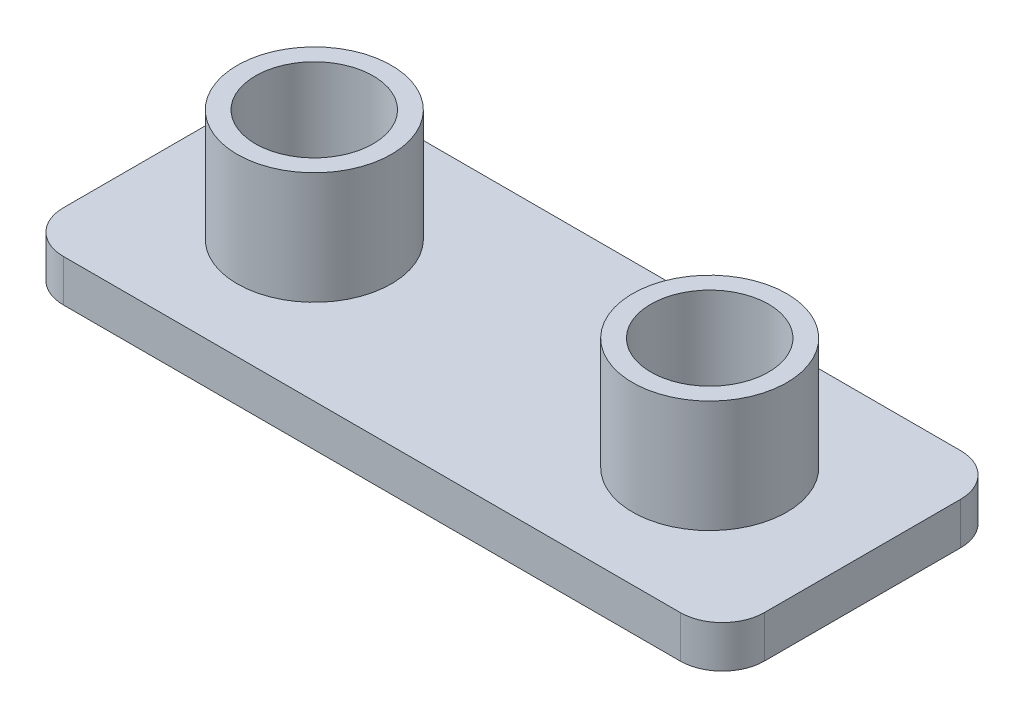
ISO-10303-21;
HEADER;
FILE_DESCRIPTION(('STEP AP214'),'2;1');
FILE_NAME('part.step','',(''),(''),'','','');
FILE_SCHEMA(('AUTOMOTIVE_DESIGN { 1 0 10303 214 1 1 1 1 }'));
ENDSEC;
DATA;
#1=APPLICATION_CONTEXT('core data for automotive mechanical design processes');
#2=APPLICATION_PROTOCOL_DEFINITION('international standard','automotive_design',2000,#1);
#3=PRODUCT_CONTEXT('',#1,'mechanical');
#4=PRODUCT('Part','Part','',(#3));
#5=PRODUCT_RELATED_PRODUCT_CATEGORY('part','',(#4));
#6=PRODUCT_DEFINITION_FORMATION('','',#4);
#7=PRODUCT_DEFINITION_CONTEXT('part definition',#1,'design');
#8=PRODUCT_DEFINITION('design','',#6,#7);
#9=PRODUCT_DEFINITION_SHAPE('','',#8);
#10=(LENGTH_UNIT() NAMED_UNIT(*) SI_UNIT(.MILLI.,.METRE.));
#11=(NAMED_UNIT(*) PLANE_ANGLE_UNIT() SI_UNIT($,.RADIAN.));
#12=(NAMED_UNIT(*) SI_UNIT($,.STERADIAN.) SOLID_ANGLE_UNIT());
#13=UNCERTAINTY_MEASURE_WITH_UNIT(LENGTH_MEASURE(1.E-05),#10,'distance_accuracy_value','');
#14=(GEOMETRIC_REPRESENTATION_CONTEXT(3) GLOBAL_UNCERTAINTY_ASSIGNED_CONTEXT((#13)) GLOBAL_UNIT_ASSIGNED_CONTEXT((#10,
#11,#12)) REPRESENTATION_CONTEXT('',''));
#15=CARTESIAN_POINT('',(0.,0.,0.));
#16=DIRECTION('',(0.,0.,1.));
#17=DIRECTION('',(1.,0.,0.));
#18=AXIS2_PLACEMENT_3D('',#15,#16,#17);
#19=CARTESIAN_POINT('',(-11.,1.5,3.5));
#20=DIRECTION('',(0.,1.,0.));
#21=DIRECTION('',(0.,0.,1.));
#22=AXIS2_PLACEMENT_3D('',#19,#20,#21);
#23=PLANE('',#22);
#24=CARTESIAN_POINT('',(-7.05,1.5,0.));
#25=DIRECTION('',(0.,1.,0.));
#26=DIRECTION('',(0.,0.,1.));
#27=AXIS2_PLACEMENT_3D('',#24,#25,#26);
#28=CIRCLE('',#27,2.75);
#29=CARTESIAN_POINT('',(-7.05,1.5,2.75));
#30=VERTEX_POINT('',#29);
#31=EDGE_CURVE('E187',#30,#30,#28,.T.);
#32=ORIENTED_EDGE('',*,*,#31,.F.);
#33=EDGE_LOOP('',(#32));
#34=FACE_BOUND('',#33,.T.);
#35=CARTESIAN_POINT('',(-11.,1.5,3.5));
#36=DIRECTION('',(0.,1.,0.));
#37=DIRECTION('',(0.,0.,1.));
#38=AXIS2_PLACEMENT_3D('',#35,#36,#37);
#39=CIRCLE('',#38,1.5);
#40=CARTESIAN_POINT('',(-12.5,1.5,3.49999999999999));
#41=VERTEX_POINT('',#40);
#42=CARTESIAN_POINT('',(-11.,1.5,5.));
#43=VERTEX_POINT('',#42);
#44=EDGE_CURVE('E147',#41,#43,#39,.T.);
#45=ORIENTED_EDGE('',*,*,#44,.T.);
#46=DIRECTION('',(1.,0.,0.));
#47=VECTOR('',#46,1.);
#48=CARTESIAN_POINT('',(-11.,1.5,5.));
#49=LINE('',#48,#47);
#50=CARTESIAN_POINT('',(11.,1.5,5.));
#51=VERTEX_POINT('',#50);
#52=EDGE_CURVE('E95',#43,#51,#49,.T.);
#53=ORIENTED_EDGE('',*,*,#52,.T.);
#54=CARTESIAN_POINT('',(11.,1.5,3.5));
#55=DIRECTION('',(0.,1.,0.));
#56=DIRECTION('',(0.,0.,1.));
#57=AXIS2_PLACEMENT_3D('',#54,#55,#56);
#58=CIRCLE('',#57,1.5);
#59=CARTESIAN_POINT('',(12.5,1.5,3.49999999999999));
#60=VERTEX_POINT('',#59);
#61=EDGE_CURVE('E162',#51,#60,#58,.T.);
#62=ORIENTED_EDGE('',*,*,#61,.T.);
#63=DIRECTION('',(0.,0.,-1.));
#64=VECTOR('',#63,1.);
#65=CARTESIAN_POINT('',(12.5,1.5,-3.49999999999999));
#66=LINE('',#65,#64);
#67=CARTESIAN_POINT('',(12.5,1.5,-3.49999999999999));
#68=VERTEX_POINT('',#67);
#69=EDGE_CURVE('E175',#60,#68,#66,.T.);
#70=ORIENTED_EDGE('',*,*,#69,.T.);
#71=CARTESIAN_POINT('',(11.,1.5,-3.5));
#72=DIRECTION('',(0.,1.,0.));
#73=DIRECTION('',(0.,0.,-1.));
#74=AXIS2_PLACEMENT_3D('',#71,#72,#73);
#75=CIRCLE('',#74,1.5);
#76=CARTESIAN_POINT('',(11.,1.5,-5.));
#77=VERTEX_POINT('',#76);
#78=EDGE_CURVE('E114',#68,#77,#75,.T.);
#79=ORIENTED_EDGE('',*,*,#78,.T.);
#80=DIRECTION('',(-1.,0.,0.));
#81=VECTOR('',#80,1.);
#82=CARTESIAN_POINT('',(-11.,1.5,-5.));
#83=LINE('',#82,#81);
#84=CARTESIAN_POINT('',(-11.,1.5,-5.));
#85=VERTEX_POINT('',#84);
#86=EDGE_CURVE('E108',#77,#85,#83,.T.);
#87=ORIENTED_EDGE('',*,*,#86,.T.);
#88=CARTESIAN_POINT('',(-11.,1.5,-3.5));
#89=DIRECTION('',(0.,1.,0.));
#90=DIRECTION('',(0.,0.,1.));
#91=AXIS2_PLACEMENT_3D('',#88,#89,#90);
#92=CIRCLE('',#91,1.5);
#93=CARTESIAN_POINT('',(-12.5,1.5,-3.49999999999999));
#94=VERTEX_POINT('',#93);
#95=EDGE_CURVE('E112',#85,#94,#92,.T.);
#96=ORIENTED_EDGE('',*,*,#95,.T.);
#97=DIRECTION('',(0.,0.,1.));
#98=VECTOR('',#97,1.);
#99=CARTESIAN_POINT('',(-12.5,1.5,-3.49999999999999));
#100=LINE('',#99,#98);
#101=EDGE_CURVE('E52',#94,#41,#100,.T.);
#102=ORIENTED_EDGE('',*,*,#101,.T.);
#103=EDGE_LOOP('',(#45,#53,#62,#70,#79,#87,#96,#102));
#104=FACE_BOUND('',#103,.T.);
#105=CARTESIAN_POINT('',(7.05,1.5,0.));
#106=DIRECTION('',(0.,1.,0.));
#107=DIRECTION('',(0.,0.,-1.));
#108=AXIS2_PLACEMENT_3D('',#105,#106,#107);
#109=CIRCLE('',#108,2.75);
#110=CARTESIAN_POINT('',(7.05,1.5,-2.75));
#111=VERTEX_POINT('',#110);
#112=EDGE_CURVE('E196',#111,#111,#109,.T.);
#113=ORIENTED_EDGE('',*,*,#112,.F.);
#114=EDGE_LOOP('',(#113));
#115=FACE_BOUND('',#114,.T.);
#116=ADVANCED_FACE('F35',(#34,#104,#115),#23,.T.);
#117=CARTESIAN_POINT('',(-11.,0.,3.5));
#118=DIRECTION('',(0.,1.,0.));
#119=DIRECTION('',(0.,0.,1.));
#120=AXIS2_PLACEMENT_3D('',#117,#118,#119);
#121=PLANE('',#120);
#122=CARTESIAN_POINT('',(-11.,0.,3.5));
#123=DIRECTION('',(0.,1.,0.));
#124=DIRECTION('',(0.,0.,1.));
#125=AXIS2_PLACEMENT_3D('',#122,#123,#124);
#126=CIRCLE('',#125,1.5);
#127=CARTESIAN_POINT('',(-12.5,0.,3.49999999999999));
#128=VERTEX_POINT('',#127);
#129=CARTESIAN_POINT('',(-11.,0.,5.));
#130=VERTEX_POINT('',#129);
#131=EDGE_CURVE('E132',#128,#130,#126,.T.);
#132=ORIENTED_EDGE('',*,*,#131,.F.);
#133=DIRECTION('',(0.,0.,1.));
#134=VECTOR('',#133,1.);
#135=CARTESIAN_POINT('',(-12.5,0.,-3.49999999999999));
#136=LINE('',#135,#134);
#137=CARTESIAN_POINT('',(-12.5,0.,-3.49999999999999));
#138=VERTEX_POINT('',#137);
#139=EDGE_CURVE('E87',#138,#128,#136,.T.);
#140=ORIENTED_EDGE('',*,*,#139,.F.);
#141=CARTESIAN_POINT('',(-11.,0.,-3.5));
#142=DIRECTION('',(0.,1.,0.));
#143=DIRECTION('',(0.,0.,1.));
#144=AXIS2_PLACEMENT_3D('',#141,#142,#143);
#145=CIRCLE('',#144,1.5);
#146=CARTESIAN_POINT('',(-11.,0.,-5.));
#147=VERTEX_POINT('',#146);
#148=EDGE_CURVE('E81',#147,#138,#145,.T.);
#149=ORIENTED_EDGE('',*,*,#148,.F.);
#150=DIRECTION('',(-1.,0.,0.));
#151=VECTOR('',#150,1.);
#152=CARTESIAN_POINT('',(-11.,0.,-5.));
#153=LINE('',#152,#151);
#154=CARTESIAN_POINT('',(11.,0.,-5.));
#155=VERTEX_POINT('',#154);
#156=EDGE_CURVE('E122',#155,#147,#153,.T.);
#157=ORIENTED_EDGE('',*,*,#156,.F.);
#158=CARTESIAN_POINT('',(11.,0.,-3.5));
#159=DIRECTION('',(0.,1.,0.));
#160=DIRECTION('',(0.,0.,-1.));
#161=AXIS2_PLACEMENT_3D('',#158,#159,#160);
#162=CIRCLE('',#161,1.5);
#163=CARTESIAN_POINT('',(12.5,0.,-3.49999999999999));
#164=VERTEX_POINT('',#163);
#165=EDGE_CURVE('E142',#164,#155,#162,.T.);
#166=ORIENTED_EDGE('',*,*,#165,.F.);
#167=DIRECTION('',(0.,0.,-1.));
#168=VECTOR('',#167,1.);
#169=CARTESIAN_POINT('',(12.5,0.,-3.49999999999999));
#170=LINE('',#169,#168);
#171=CARTESIAN_POINT('',(12.5,0.,3.49999999999999));
#172=VERTEX_POINT('',#171);
#173=EDGE_CURVE('E140',#172,#164,#170,.T.);
#174=ORIENTED_EDGE('',*,*,#173,.F.);
#175=CARTESIAN_POINT('',(11.,0.,3.5));
#176=DIRECTION('',(0.,1.,0.));
#177=DIRECTION('',(0.,0.,1.));
#178=AXIS2_PLACEMENT_3D('',#175,#176,#177);
#179=CIRCLE('',#178,1.5);
#180=CARTESIAN_POINT('',(11.,0.,5.));
#181=VERTEX_POINT('',#180);
#182=EDGE_CURVE('E138',#181,#172,#179,.T.);
#183=ORIENTED_EDGE('',*,*,#182,.F.);
#184=DIRECTION('',(1.,0.,0.));
#185=VECTOR('',#184,1.);
#186=CARTESIAN_POINT('',(-11.,0.,5.));
#187=LINE('',#186,#185);
#188=EDGE_CURVE('E135',#130,#181,#187,.T.);
#189=ORIENTED_EDGE('',*,*,#188,.F.);
#190=EDGE_LOOP('',(#132,#140,#149,#157,#166,#174,#183,#189));
#191=FACE_BOUND('',#190,.T.);
#192=CARTESIAN_POINT('',(-7.05,0.,0.));
#193=DIRECTION('',(0.,1.,0.));
#194=DIRECTION('',(0.,0.,1.));
#195=AXIS2_PLACEMENT_3D('',#192,#193,#194);
#196=CIRCLE('',#195,2.1);
#197=CARTESIAN_POINT('',(-7.05,0.,2.1));
#198=VERTEX_POINT('',#197);
#199=EDGE_CURVE('E136',#198,#198,#196,.T.);
#200=ORIENTED_EDGE('',*,*,#199,.T.);
#201=EDGE_LOOP('',(#200));
#202=FACE_BOUND('',#201,.T.);
#203=CARTESIAN_POINT('',(7.05,0.,0.));
#204=DIRECTION('',(0.,1.,0.));
#205=DIRECTION('',(0.,0.,-1.));
#206=AXIS2_PLACEMENT_3D('',#203,#204,#205);
#207=CIRCLE('',#206,2.1);
#208=CARTESIAN_POINT('',(7.05,0.,-2.1));
#209=VERTEX_POINT('',#208);
#210=EDGE_CURVE('E183',#209,#209,#207,.T.);
#211=ORIENTED_EDGE('',*,*,#210,.T.);
#212=EDGE_LOOP('',(#211));
#213=FACE_BOUND('',#212,.T.);
#214=ADVANCED_FACE('F166',(#191,#202,#213),#121,.F.);
#215=CARTESIAN_POINT('',(-11.,1.5,3.5));
#216=DIRECTION('',(0.,-1.,0.));
#217=DIRECTION('',(0.,0.,-1.));
#218=AXIS2_PLACEMENT_3D('',#215,#216,#217);
#219=CYLINDRICAL_SURFACE('',#218,1.5);
#220=ORIENTED_EDGE('',*,*,#131,.T.);
#221=DIRECTION('',(0.,-1.,0.));
#222=VECTOR('',#221,1.);
#223=CARTESIAN_POINT('',(-11.,1.5,5.));
#224=LINE('',#223,#222);
#225=EDGE_CURVE('E11',#43,#130,#224,.T.);
#226=ORIENTED_EDGE('',*,*,#225,.F.);
#227=ORIENTED_EDGE('',*,*,#44,.F.);
#228=DIRECTION('',(0.,-1.,0.));
#229=VECTOR('',#228,1.);
#230=CARTESIAN_POINT('',(-12.5,1.5,3.49999999999999));
#231=LINE('',#230,#229);
#232=EDGE_CURVE('E128',#41,#128,#231,.T.);
#233=ORIENTED_EDGE('',*,*,#232,.T.);
#234=EDGE_LOOP('',(#220,#226,#227,#233));
#235=FACE_BOUND('',#234,.T.);
#236=ADVANCED_FACE('F37',(#235),#219,.T.);
#237=CARTESIAN_POINT('',(-11.,1.5,5.));
#238=DIRECTION('',(0.,0.,-1.));
#239=DIRECTION('',(-1.,0.,0.));
#240=AXIS2_PLACEMENT_3D('',#237,#238,#239);
#241=PLANE('',#240);
#242=ORIENTED_EDGE('',*,*,#188,.T.);
#243=DIRECTION('',(0.,-1.,0.));
#244=VECTOR('',#243,1.);
#245=CARTESIAN_POINT('',(11.,1.5,5.));
#246=LINE('',#245,#244);
#247=EDGE_CURVE('E44',#51,#181,#246,.T.);
#248=ORIENTED_EDGE('',*,*,#247,.F.);
#249=ORIENTED_EDGE('',*,*,#52,.F.);
#250=ORIENTED_EDGE('',*,*,#225,.T.);
#251=EDGE_LOOP('',(#242,#248,#249,#250));
#252=FACE_BOUND('',#251,.T.);
#253=ADVANCED_FACE('F246',(#252),#241,.F.);
#254=CARTESIAN_POINT('',(11.,1.5,3.5));
#255=DIRECTION('',(0.,-1.,0.));
#256=DIRECTION('',(0.,0.,-1.));
#257=AXIS2_PLACEMENT_3D('',#254,#255,#256);
#258=CYLINDRICAL_SURFACE('',#257,1.5);
#259=ORIENTED_EDGE('',*,*,#182,.T.);
#260=DIRECTION('',(0.,-1.,0.));
#261=VECTOR('',#260,1.);
#262=CARTESIAN_POINT('',(12.5,1.5,3.49999999999999));
#263=LINE('',#262,#261);
#264=EDGE_CURVE('E154',#60,#172,#263,.T.);
#265=ORIENTED_EDGE('',*,*,#264,.F.);
#266=ORIENTED_EDGE('',*,*,#61,.F.);
#267=ORIENTED_EDGE('',*,*,#247,.T.);
#268=EDGE_LOOP('',(#259,#265,#266,#267));
#269=FACE_BOUND('',#268,.T.);
#270=ADVANCED_FACE('F160',(#269),#258,.T.);
#271=CARTESIAN_POINT('',(12.5,1.5,-3.49999999999999));
#272=DIRECTION('',(-1.,0.,0.));
#273=DIRECTION('',(0.,0.,1.));
#274=AXIS2_PLACEMENT_3D('',#271,#272,#273);
#275=PLANE('',#274);
#276=ORIENTED_EDGE('',*,*,#173,.T.);
#277=DIRECTION('',(0.,-1.,0.));
#278=VECTOR('',#277,1.);
#279=CARTESIAN_POINT('',(12.5,1.5,-3.49999999999999));
#280=LINE('',#279,#278);
#281=EDGE_CURVE('E151',#68,#164,#280,.T.);
#282=ORIENTED_EDGE('',*,*,#281,.F.);
#283=ORIENTED_EDGE('',*,*,#69,.F.);
#284=ORIENTED_EDGE('',*,*,#264,.T.);
#285=EDGE_LOOP('',(#276,#282,#283,#284));
#286=FACE_BOUND('',#285,.T.);
#287=ADVANCED_FACE('F171',(#286),#275,.F.);
#288=CARTESIAN_POINT('',(11.,1.5,-3.5));
#289=DIRECTION('',(0.,-1.,0.));
#290=DIRECTION('',(0.,0.,-1.));
#291=AXIS2_PLACEMENT_3D('',#288,#289,#290);
#292=CYLINDRICAL_SURFACE('',#291,1.5);
#293=ORIENTED_EDGE('',*,*,#165,.T.);
#294=DIRECTION('',(0.,-1.,0.));
#295=VECTOR('',#294,1.);
#296=CARTESIAN_POINT('',(11.,1.5,-5.));
#297=LINE('',#296,#295);
#298=EDGE_CURVE('E123',#77,#155,#297,.T.);
#299=ORIENTED_EDGE('',*,*,#298,.F.);
#300=ORIENTED_EDGE('',*,*,#78,.F.);
#301=ORIENTED_EDGE('',*,*,#281,.T.);
#302=EDGE_LOOP('',(#293,#299,#300,#301));
#303=FACE_BOUND('',#302,.T.);
#304=ADVANCED_FACE('F174',(#303),#292,.T.);
#305=CARTESIAN_POINT('',(-11.,1.5,-5.));
#306=DIRECTION('',(0.,0.,1.));
#307=DIRECTION('',(1.,0.,0.));
#308=AXIS2_PLACEMENT_3D('',#305,#306,#307);
#309=PLANE('',#308);
#310=ORIENTED_EDGE('',*,*,#156,.T.);
#311=DIRECTION('',(0.,-1.,0.));
#312=VECTOR('',#311,1.);
#313=CARTESIAN_POINT('',(-11.,1.5,-5.));
#314=LINE('',#313,#312);
#315=EDGE_CURVE('E119',#85,#147,#314,.T.);
#316=ORIENTED_EDGE('',*,*,#315,.F.);
#317=ORIENTED_EDGE('',*,*,#86,.F.);
#318=ORIENTED_EDGE('',*,*,#298,.T.);
#319=EDGE_LOOP('',(#310,#316,#317,#318));
#320=FACE_BOUND('',#319,.T.);
#321=ADVANCED_FACE('F120',(#320),#309,.F.);
#322=CARTESIAN_POINT('',(-11.,1.5,-3.5));
#323=DIRECTION('',(0.,-1.,0.));
#324=DIRECTION('',(0.,0.,-1.));
#325=AXIS2_PLACEMENT_3D('',#322,#323,#324);
#326=CYLINDRICAL_SURFACE('',#325,1.5);
#327=ORIENTED_EDGE('',*,*,#148,.T.);
#328=DIRECTION('',(0.,-1.,0.));
#329=VECTOR('',#328,1.);
#330=CARTESIAN_POINT('',(-12.5,1.5,-3.49999999999999));
#331=LINE('',#330,#329);
#332=EDGE_CURVE('E124',#94,#138,#331,.T.);
#333=ORIENTED_EDGE('',*,*,#332,.F.);
#334=ORIENTED_EDGE('',*,*,#95,.F.);
#335=ORIENTED_EDGE('',*,*,#315,.T.);
#336=EDGE_LOOP('',(#327,#333,#334,#335));
#337=FACE_BOUND('',#336,.T.);
#338=ADVANCED_FACE('F126',(#337),#326,.T.);
#339=CARTESIAN_POINT('',(-12.5,1.5,-3.49999999999999));
#340=DIRECTION('',(1.,0.,0.));
#341=DIRECTION('',(0.,0.,-1.));
#342=AXIS2_PLACEMENT_3D('',#339,#340,#341);
#343=PLANE('',#342);
#344=ORIENTED_EDGE('',*,*,#139,.T.);
#345=ORIENTED_EDGE('',*,*,#232,.F.);
#346=ORIENTED_EDGE('',*,*,#101,.F.);
#347=ORIENTED_EDGE('',*,*,#332,.T.);
#348=EDGE_LOOP('',(#344,#345,#346,#347));
#349=FACE_BOUND('',#348,.T.);
#350=ADVANCED_FACE('F234',(#349),#343,.F.);
#351=CARTESIAN_POINT('',(-7.05,1.5,0.));
#352=DIRECTION('',(0.,-1.,0.));
#353=DIRECTION('',(0.,0.,-1.));
#354=AXIS2_PLACEMENT_3D('',#351,#352,#353);
#355=CYLINDRICAL_SURFACE('',#354,2.1);
#356=ORIENTED_EDGE('',*,*,#199,.F.);
#357=EDGE_LOOP('',(#356));
#358=FACE_BOUND('',#357,.T.);
#359=CARTESIAN_POINT('',(-7.05,5.5,0.));
#360=DIRECTION('',(0.,1.,0.));
#361=DIRECTION('',(0.,0.,1.));
#362=AXIS2_PLACEMENT_3D('',#359,#360,#361);
#363=CIRCLE('',#362,2.1);
#364=CARTESIAN_POINT('',(-7.05,5.5,2.1));
#365=VERTEX_POINT('',#364);
#366=EDGE_CURVE('E190',#365,#365,#363,.T.);
#367=ORIENTED_EDGE('',*,*,#366,.T.);
#368=EDGE_LOOP('',(#367));
#369=FACE_BOUND('',#368,.T.);
#370=ADVANCED_FACE('F231',(#358,#369),#355,.F.);
#371=CARTESIAN_POINT('',(7.05,1.5,0.));
#372=DIRECTION('',(0.,-1.,0.));
#373=DIRECTION('',(0.,0.,-1.));
#374=AXIS2_PLACEMENT_3D('',#371,#372,#373);
#375=CYLINDRICAL_SURFACE('',#374,2.1);
#376=ORIENTED_EDGE('',*,*,#210,.F.);
#377=EDGE_LOOP('',(#376));
#378=FACE_BOUND('',#377,.T.);
#379=CARTESIAN_POINT('',(7.05,5.5,0.));
#380=DIRECTION('',(0.,1.,0.));
#381=DIRECTION('',(0.,0.,-1.));
#382=AXIS2_PLACEMENT_3D('',#379,#380,#381);
#383=CIRCLE('',#382,2.1);
#384=CARTESIAN_POINT('',(7.05,5.5,-2.1));
#385=VERTEX_POINT('',#384);
#386=EDGE_CURVE('E199',#385,#385,#383,.T.);
#387=ORIENTED_EDGE('',*,*,#386,.T.);
#388=EDGE_LOOP('',(#387));
#389=FACE_BOUND('',#388,.T.);
#390=ADVANCED_FACE('F205',(#378,#389),#375,.F.);
#391=CARTESIAN_POINT('',(-7.05,5.5,0.));
#392=DIRECTION('',(0.,1.,0.));
#393=DIRECTION('',(0.,0.,1.));
#394=AXIS2_PLACEMENT_3D('',#391,#392,#393);
#395=PLANE('',#394);
#396=CARTESIAN_POINT('',(-7.05,5.5,0.));
#397=DIRECTION('',(0.,1.,0.));
#398=DIRECTION('',(0.,0.,1.));
#399=AXIS2_PLACEMENT_3D('',#396,#397,#398);
#400=CIRCLE('',#399,2.75);
#401=CARTESIAN_POINT('',(-7.05,5.5,2.75));
#402=VERTEX_POINT('',#401);
#403=EDGE_CURVE('E186',#402,#402,#400,.T.);
#404=ORIENTED_EDGE('',*,*,#403,.T.);
#405=EDGE_LOOP('',(#404));
#406=FACE_BOUND('',#405,.T.);
#407=ORIENTED_EDGE('',*,*,#366,.F.);
#408=EDGE_LOOP('',(#407));
#409=FACE_BOUND('',#408,.T.);
#410=ADVANCED_FACE('F219',(#406,#409),#395,.T.);
#411=CARTESIAN_POINT('',(-7.05,5.5,0.));
#412=DIRECTION('',(0.,-1.,0.));
#413=DIRECTION('',(0.,0.,-1.));
#414=AXIS2_PLACEMENT_3D('',#411,#412,#413);
#415=CYLINDRICAL_SURFACE('',#414,2.75);
#416=ORIENTED_EDGE('',*,*,#403,.F.);
#417=EDGE_LOOP('',(#416));
#418=FACE_BOUND('',#417,.T.);
#419=ORIENTED_EDGE('',*,*,#31,.T.);
#420=EDGE_LOOP('',(#419));
#421=FACE_BOUND('',#420,.T.);
#422=ADVANCED_FACE('F210',(#418,#421),#415,.T.);
#423=CARTESIAN_POINT('',(7.05,5.5,0.));
#424=DIRECTION('',(0.,-1.,0.));
#425=DIRECTION('',(0.,0.,-1.));
#426=AXIS2_PLACEMENT_3D('',#423,#424,#425);
#427=PLANE('',#426);
#428=CARTESIAN_POINT('',(7.05,5.5,0.));
#429=DIRECTION('',(0.,1.,0.));
#430=DIRECTION('',(0.,0.,-1.));
#431=AXIS2_PLACEMENT_3D('',#428,#429,#430);
#432=CIRCLE('',#431,2.75);
#433=CARTESIAN_POINT('',(7.05,5.5,-2.75));
#434=VERTEX_POINT('',#433);
#435=EDGE_CURVE('E195',#434,#434,#432,.T.);
#436=ORIENTED_EDGE('',*,*,#435,.T.);
#437=EDGE_LOOP('',(#436));
#438=FACE_BOUND('',#437,.T.);
#439=ORIENTED_EDGE('',*,*,#386,.F.);
#440=EDGE_LOOP('',(#439));
#441=FACE_BOUND('',#440,.T.);
#442=ADVANCED_FACE('F207',(#438,#441),#427,.F.);
#443=CARTESIAN_POINT('',(7.05,5.5,0.));
#444=DIRECTION('',(0.,-1.,0.));
#445=DIRECTION('',(0.,0.,-1.));
#446=AXIS2_PLACEMENT_3D('',#443,#444,#445);
#447=CYLINDRICAL_SURFACE('',#446,2.75);
#448=ORIENTED_EDGE('',*,*,#435,.F.);
#449=EDGE_LOOP('',(#448));
#450=FACE_BOUND('',#449,.T.);
#451=ORIENTED_EDGE('',*,*,#112,.T.);
#452=EDGE_LOOP('',(#451));
#453=FACE_BOUND('',#452,.T.);
#454=ADVANCED_FACE('F209',(#450,#453),#447,.T.);
#455=CLOSED_SHELL('',(#116,#214,#236,#253,#270,#287,#304,#321,#338,#350,#370,#390,#410,#422,
#442,#454));
#456=MANIFOLD_SOLID_BREP('B2',#455);
#457=ADVANCED_BREP_SHAPE_REPRESENTATION('',(#18,#456),#14);
#458=SHAPE_DEFINITION_REPRESENTATION(#9,#457);
ENDSEC;
END-ISO-10303-21;
